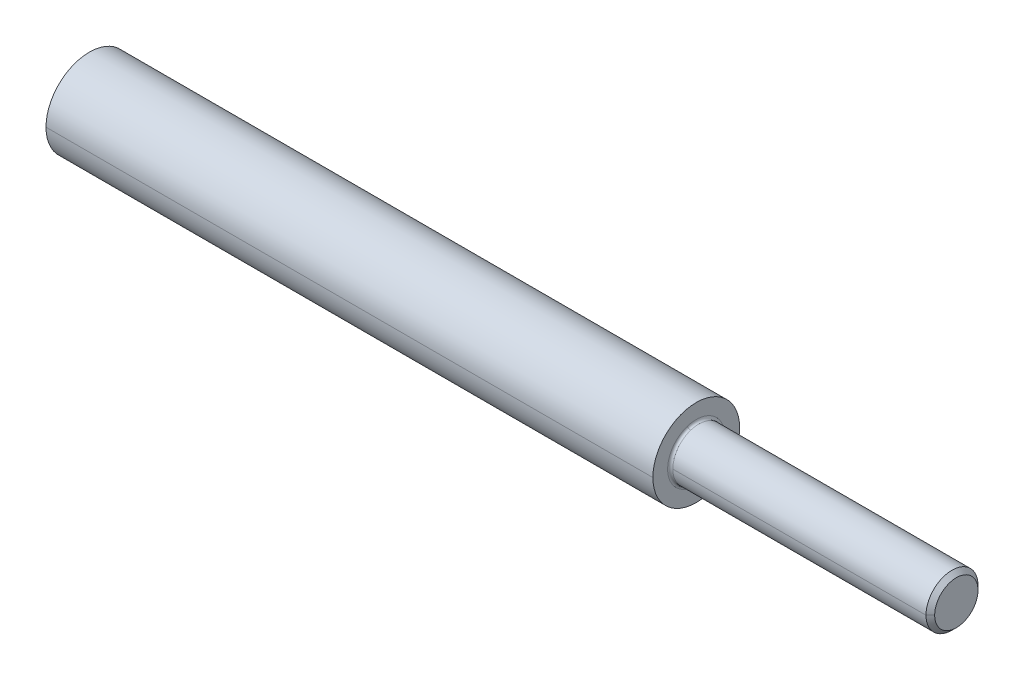
ISO-10303-21;
HEADER;
FILE_DESCRIPTION(('STEP AP214'),'2;1');
FILE_NAME('part.step','',(''),(''),'','','');
FILE_SCHEMA(('AUTOMOTIVE_DESIGN { 1 0 10303 214 1 1 1 1 }'));
ENDSEC;
DATA;
#1=APPLICATION_CONTEXT('core data for automotive mechanical design processes');
#2=APPLICATION_PROTOCOL_DEFINITION('international standard','automotive_design',2000,#1);
#3=PRODUCT_CONTEXT('',#1,'mechanical');
#4=PRODUCT('Part','Part','',(#3));
#5=PRODUCT_RELATED_PRODUCT_CATEGORY('part','',(#4));
#6=PRODUCT_DEFINITION_FORMATION('','',#4);
#7=PRODUCT_DEFINITION_CONTEXT('part definition',#1,'design');
#8=PRODUCT_DEFINITION('design','',#6,#7);
#9=PRODUCT_DEFINITION_SHAPE('','',#8);
#10=(LENGTH_UNIT() NAMED_UNIT(*) SI_UNIT(.MILLI.,.METRE.));
#11=(NAMED_UNIT(*) PLANE_ANGLE_UNIT() SI_UNIT($,.RADIAN.));
#12=(NAMED_UNIT(*) SI_UNIT($,.STERADIAN.) SOLID_ANGLE_UNIT());
#13=UNCERTAINTY_MEASURE_WITH_UNIT(LENGTH_MEASURE(1.E-05),#10,'distance_accuracy_value','');
#14=(GEOMETRIC_REPRESENTATION_CONTEXT(3) GLOBAL_UNCERTAINTY_ASSIGNED_CONTEXT((#13)) GLOBAL_UNIT_ASSIGNED_CONTEXT((#10,
#11,#12)) REPRESENTATION_CONTEXT('',''));
#15=CARTESIAN_POINT('',(0.,0.,0.));
#16=DIRECTION('',(0.,0.,1.));
#17=DIRECTION('',(1.,0.,0.));
#18=AXIS2_PLACEMENT_3D('',#15,#16,#17);
#19=CARTESIAN_POINT('',(0.,0.,0.));
#20=DIRECTION('',(1.,0.,0.));
#21=DIRECTION('',(0.,0.,-1.));
#22=AXIS2_PLACEMENT_3D('',#19,#20,#21);
#23=PLANE('',#22);
#24=CARTESIAN_POINT('',(0.,0.,0.));
#25=DIRECTION('',(1.,0.,0.));
#26=DIRECTION('',(0.,0.,-1.));
#27=AXIS2_PLACEMENT_3D('',#24,#25,#26);
#28=CIRCLE('',#27,5.);
#29=CARTESIAN_POINT('',(0.,0.,5.));
#30=VERTEX_POINT('',#29);
#31=CARTESIAN_POINT('',(0.,0.,-5.));
#32=VERTEX_POINT('',#31);
#33=EDGE_CURVE('E11',#30,#32,#28,.T.);
#34=ORIENTED_EDGE('',*,*,#33,.F.);
#35=CARTESIAN_POINT('',(0.,0.,0.));
#36=DIRECTION('',(1.,0.,0.));
#37=DIRECTION('',(0.,0.,-1.));
#38=AXIS2_PLACEMENT_3D('',#35,#36,#37);
#39=CIRCLE('',#38,5.);
#40=EDGE_CURVE('E24',#32,#30,#39,.T.);
#41=ORIENTED_EDGE('',*,*,#40,.F.);
#42=EDGE_LOOP('',(#34,#41));
#43=FACE_BOUND('',#42,.T.);
#44=ADVANCED_FACE('F16',(#43),#23,.F.);
#45=CARTESIAN_POINT('',(70.,0.,0.));
#46=DIRECTION('',(1.,0.,0.));
#47=DIRECTION('',(0.,-1.,0.));
#48=AXIS2_PLACEMENT_3D('',#45,#46,#47);
#49=CYLINDRICAL_SURFACE('',#48,5.);
#50=DIRECTION('',(1.,0.,0.));
#51=VECTOR('',#50,1.);
#52=CARTESIAN_POINT('',(0.,0.,5.));
#53=LINE('',#52,#51);
#54=CARTESIAN_POINT('',(70.,0.,5.));
#55=VERTEX_POINT('',#54);
#56=EDGE_CURVE('E219',#30,#55,#53,.T.);
#57=ORIENTED_EDGE('',*,*,#56,.T.);
#58=CARTESIAN_POINT('',(70.,0.,0.));
#59=DIRECTION('',(1.,0.,0.));
#60=DIRECTION('',(0.,0.,-1.));
#61=AXIS2_PLACEMENT_3D('',#58,#59,#60);
#62=CIRCLE('',#61,5.);
#63=CARTESIAN_POINT('',(70.,0.,-5.));
#64=VERTEX_POINT('',#63);
#65=EDGE_CURVE('E222',#64,#55,#62,.T.);
#66=ORIENTED_EDGE('',*,*,#65,.F.);
#67=DIRECTION('',(1.,0.,0.));
#68=VECTOR('',#67,1.);
#69=CARTESIAN_POINT('',(0.,0.,-5.));
#70=LINE('',#69,#68);
#71=EDGE_CURVE('E226',#32,#64,#70,.T.);
#72=ORIENTED_EDGE('',*,*,#71,.F.);
#73=ORIENTED_EDGE('',*,*,#40,.T.);
#74=EDGE_LOOP('',(#57,#66,#72,#73));
#75=FACE_BOUND('',#74,.T.);
#76=ADVANCED_FACE('F210',(#75),#49,.T.);
#77=CARTESIAN_POINT('',(70.,0.,0.));
#78=DIRECTION('',(1.,0.,0.));
#79=DIRECTION('',(0.,1.,0.));
#80=AXIS2_PLACEMENT_3D('',#77,#78,#79);
#81=CYLINDRICAL_SURFACE('',#80,5.);
#82=ORIENTED_EDGE('',*,*,#56,.F.);
#83=ORIENTED_EDGE('',*,*,#33,.T.);
#84=ORIENTED_EDGE('',*,*,#71,.T.);
#85=CARTESIAN_POINT('',(70.,0.,0.));
#86=DIRECTION('',(1.,0.,0.));
#87=DIRECTION('',(0.,0.,-1.));
#88=AXIS2_PLACEMENT_3D('',#85,#86,#87);
#89=CIRCLE('',#88,5.);
#90=EDGE_CURVE('E189',#55,#64,#89,.T.);
#91=ORIENTED_EDGE('',*,*,#90,.F.);
#92=EDGE_LOOP('',(#82,#83,#84,#91));
#93=FACE_BOUND('',#92,.T.);
#94=ADVANCED_FACE('F159',(#93),#81,.T.);
#95=CARTESIAN_POINT('',(70.,5.,0.));
#96=DIRECTION('',(-1.,0.,0.));
#97=DIRECTION('',(0.,0.,1.));
#98=AXIS2_PLACEMENT_3D('',#95,#96,#97);
#99=PLANE('',#98);
#100=CARTESIAN_POINT('',(70.0000000000001,3.13848650377388,1.01975608143728));
#101=CARTESIAN_POINT('',(70.0000000000001,3.12180185639339,1.07110985257327));
#102=CARTESIAN_POINT('',(70.0000000000001,3.10385469803049,1.12205330654705));
#103=CARTESIAN_POINT('',(70.0000000000001,3.06548330203598,1.2229986419036));
#104=CARTESIAN_POINT('',(70.0000000000001,3.04505906440437,1.27300052328636));
#105=CARTESIAN_POINT('',(70.0000000000001,3.00178145256848,1.37194177519426));
#106=CARTESIAN_POINT('',(70.0000000000001,2.97892807836422,1.4208811457194));
#107=CARTESIAN_POINT('',(70.0000000000001,2.93084758706894,1.51757960512457));
#108=CARTESIAN_POINT('',(70.0000000000001,2.90562046997793,1.56533869400461));
#109=CARTESIAN_POINT('',(70.0000000000001,2.8528531767023,1.65956149987516));
#110=CARTESIAN_POINT('',(70.0000000000001,2.82531300051768,1.70602521686567));
#111=CARTESIAN_POINT('',(70.0000000000001,2.76798596001204,1.79754535301495));
#112=CARTESIAN_POINT('',(70.0000000000001,2.73819909569102,1.84260177217373));
#113=CARTESIAN_POINT('',(70.0000000000001,2.67645043157715,1.93119876532836));
#114=CARTESIAN_POINT('',(70.0000000000001,2.64448863178431,1.97473933932421));
#115=CARTESIAN_POINT('',(70.0000000000001,2.57846709724384,2.06019974975861));
#116=CARTESIAN_POINT('',(70.0000000000001,2.54440736249622,2.10211958619717));
#117=CARTESIAN_POINT('',(70.0000000000001,2.47427201046378,2.18423753278186));
#118=CARTESIAN_POINT('',(70.0000000000001,2.43819639317895,2.224435642928));
#119=CARTESIAN_POINT('',(70.0000000000001,2.36411618551905,2.30301329620709));
#120=CARTESIAN_POINT('',(70.0000000000001,2.32611159514396,2.34139283934005));
#121=CARTESIAN_POINT('',(70.0000000000001,2.24826499765705,2.41624089889901));
#122=CARTESIAN_POINT('',(70.0000000000001,2.20842299054522,2.45270941532501));
#123=CARTESIAN_POINT('',(70.0000000000001,2.12699754247868,2.52364756562312));
#124=CARTESIAN_POINT('',(70.0000000000001,2.08541410152396,2.55811719949523));
#125=CARTESIAN_POINT('',(70.0000000000001,2.00060596392078,2.62497454431747));
#126=CARTESIAN_POINT('',(70.0000000000001,1.95738126727231,2.6573622552676));
#127=CARTESIAN_POINT('',(70.0000000000001,1.86939475036253,2.71997772941361));
#128=CARTESIAN_POINT('',(70.0000000000001,1.82463293010121,2.75020549260949));
#129=CARTESIAN_POINT('',(70.0000000000001,1.73368000111125,2.80842824991777));
#130=CARTESIAN_POINT('',(70.0000000000001,1.6874888923826,2.83642324403016));
#131=CARTESIAN_POINT('',(70.0000000000001,1.59378866488479,2.89011302077859));
#132=CARTESIAN_POINT('',(70.0000000000001,1.54627954611564,2.91580780341462));
#133=CARTESIAN_POINT('',(70.0000000000001,1.45005775216525,2.96483525622836));
#134=CARTESIAN_POINT('',(70.0000000000001,1.40134507698401,2.98816792640606));
#135=CARTESIAN_POINT('',(70.0000000000001,1.30283352331068,3.03241494385698));
#136=CARTESIAN_POINT('',(70.0000000000001,1.25303464481859,3.05332929113019));
#137=CARTESIAN_POINT('',(70.0000000000001,1.15247065438371,3.09268927827766));
#138=CARTESIAN_POINT('',(70.0000000000001,1.10170554244092,3.11113491815192));
#139=CARTESIAN_POINT('',(70.0000000000001,0.999331382705825,3.14551305333939));
#140=CARTESIAN_POINT('',(70.0000000000001,0.947722334913512,3.16144554865259));
#141=CARTESIAN_POINT('',(70.0000000000001,0.843784634195911,3.19075901194122));
#142=CARTESIAN_POINT('',(70.0000000000001,0.791455981270622,3.20413997991663));
#143=CARTESIAN_POINT('',(70.0000000000001,0.686205134595414,3.2283181526058));
#144=CARTESIAN_POINT('',(70.0000000000001,0.633282940845494,3.23911535731954));
#145=CARTESIAN_POINT('',(70.0000000000001,0.526972506721205,3.25809999207348));
#146=CARTESIAN_POINT('',(70.0000000000001,0.473584266346836,3.26628742211367));
#147=CARTESIAN_POINT('',(70.0000000000001,0.366470355920966,3.2800327832844));
#148=CARTESIAN_POINT('',(70.0000000000001,0.312744685869465,3.28559071441493));
#149=CARTESIAN_POINT('',(70.0000000000001,0.2050853459343,3.29406368822344));
#150=CARTESIAN_POINT('',(70.0000000000001,0.151151676050635,3.29697873090141));
#151=CARTESIAN_POINT('',(70.0000000000001,0.0432062673859232,3.30015890521166));
#152=CARTESIAN_POINT('',(70.0000000000001,-0.0108054713951234,3.30042403684392));
#153=CARTESIAN_POINT('',(70.0000000000001,-0.118776898845007,3.29830375033743));
#154=CARTESIAN_POINT('',(70.0000000000001,-0.172736587513844,3.29591833219867));
#155=CARTESIAN_POINT('',(70.0000000000001,-0.280473921122993,3.28850269283136));
#156=CARTESIAN_POINT('',(70.0000000000001,-0.334251566063306,3.28347247160281));
#157=CARTESIAN_POINT('',(70.0000000000001,-0.44149525715838,3.27077934429944));
#158=CARTESIAN_POINT('',(70.0000000000001,-0.494961303313142,3.26311643822463));
#159=CARTESIAN_POINT('',(70.0000000000001,-0.601452992448855,3.24517640184067));
#160=CARTESIAN_POINT('',(70.0000000000001,-0.654478635429806,3.23489927153152));
#161=CARTESIAN_POINT('',(70.0000000000001,-0.759961774799459,3.21175554518598));
#162=CARTESIAN_POINT('',(70.0000000000001,-0.812419271188161,3.19888894914958));
#163=CARTESIAN_POINT('',(70.0000000000001,-0.916639742669782,3.17059728810637));
#164=CARTESIAN_POINT('',(70.0000000000001,-0.968402717762701,3.15517222309956));
#165=CARTESIAN_POINT('',(70.0000000000001,-1.07110944511186,3.1218007844482));
#166=CARTESIAN_POINT('',(70.0000000000001,-1.12205319736809,3.10385441080365));
#167=CARTESIAN_POINT('',(70.0000000000001,-1.22299875108255,3.06548358926283));
#168=CARTESIAN_POINT('',(70.0000000000001,-1.27300055254077,3.04505914136657));
#169=CARTESIAN_POINT('',(70.0000000000001,-1.37194174593984,3.00178137560628));
#170=CARTESIAN_POINT('',(70.0000000000001,-1.42088113788069,2.97892805774226));
#171=CARTESIAN_POINT('',(70.0000000000001,-1.51757961296326,2.9308476076909));
#172=CARTESIAN_POINT('',(70.0000000000001,-1.56533869610498,2.90562047550357));
#173=CARTESIAN_POINT('',(70.0000000000001,-1.65956149777478,2.85285317117666));
#174=CARTESIAN_POINT('',(70.0000000000001,-1.70602521630287,2.82531299903709));
#175=CARTESIAN_POINT('',(70.0000000000001,-1.79754535357774,2.76798596149263));
#176=CARTESIAN_POINT('',(70.0000000000001,-1.84260177232452,2.73819909608774));
#177=CARTESIAN_POINT('',(70.0000000000001,-1.93119876517755,2.67645043118043));
#178=CARTESIAN_POINT('',(70.0000000000001,-1.97473933928379,2.64448863167801));
#179=CARTESIAN_POINT('',(70.0000000000001,-2.06019974979902,2.57846709735015));
#180=CARTESIAN_POINT('',(70.0000000000001,-2.10211958620799,2.54440736252471));
#181=CARTESIAN_POINT('',(70.0000000000001,-2.18423753277103,2.4742720104353));
#182=CARTESIAN_POINT('',(70.0000000000001,-2.22443564292509,2.43819639317133));
#183=CARTESIAN_POINT('',(70.0000000000001,-2.30301329620999,2.36411618552668));
#184=CARTESIAN_POINT('',(70.0000000000001,-2.34139283934083,2.32611159514601));
#185=CARTESIAN_POINT('',(70.0000000000001,-2.41624089889823,2.24826499765501));
#186=CARTESIAN_POINT('',(70.0000000000001,-2.4527094153248,2.20842299054468));
#187=CARTESIAN_POINT('',(70.0000000000001,-2.52364756562333,2.12699754247923));
#188=CARTESIAN_POINT('',(70.0000000000001,-2.55811719949528,2.08541410152411));
#189=CARTESIAN_POINT('',(70.0000000000001,-2.62497454431741,2.00060596392064));
#190=CARTESIAN_POINT('',(70.0000000000001,-2.65736225526758,1.95738126727228));
#191=CARTESIAN_POINT('',(70.0000000000001,-2.71997772941362,1.86939475036257));
#192=CARTESIAN_POINT('',(70.0000000000001,-2.75020549260949,1.82463293010123));
#193=CARTESIAN_POINT('',(70.0000000000001,-2.80842824991776,1.73368000111124));
#194=CARTESIAN_POINT('',(70.0000000000001,-2.83642324403016,1.6874888923826));
#195=CARTESIAN_POINT('',(70.0000000000001,-2.89011302077859,1.5937886648848));
#196=CARTESIAN_POINT('',(70.0000000000001,-2.91580780341462,1.54627954611565));
#197=CARTESIAN_POINT('',(70.0000000000001,-2.96483525622836,1.45005775216525));
#198=CARTESIAN_POINT('',(70.0000000000001,-2.98816792640606,1.40134507698401));
#199=CARTESIAN_POINT('',(70.0000000000001,-3.03241494385698,1.30283352331068));
#200=CARTESIAN_POINT('',(70.0000000000001,-3.0533292911302,1.25303464481859));
#201=CARTESIAN_POINT('',(70.0000000000001,-3.09268927827765,1.15247065438372));
#202=CARTESIAN_POINT('',(70.0000000000001,-3.11113491815188,1.10170554244094));
#203=CARTESIAN_POINT('',(70.0000000000001,-3.14551305333943,0.99933138270582));
#204=CARTESIAN_POINT('',(70.0000000000001,-3.16144554865274,0.947722334913477));
#205=CARTESIAN_POINT('',(70.0000000000001,-3.19075901194106,0.843784634195958));
#206=CARTESIAN_POINT('',(70.0000000000001,-3.20413997991607,0.791455981270783));
#207=CARTESIAN_POINT('',(70.0000000000001,-3.22831815260636,0.686205134595268));
#208=CARTESIAN_POINT('',(70.0000000000001,-3.23911535732165,0.633282940844928));
#209=CARTESIAN_POINT('',(70.0000000000001,-3.25809999207136,0.526972506721785));
#210=CARTESIAN_POINT('',(70.0000000000001,-3.26628742210579,0.473584266348982));
#211=CARTESIAN_POINT('',(70.0000000000001,-3.28003278329227,0.366470355918834));
#212=CARTESIAN_POINT('',(70.0000000000001,-3.28559071444434,0.312744685861489));
#213=CARTESIAN_POINT('',(70.0000000000001,-3.29406368819403,0.205085345942289));
#214=CARTESIAN_POINT('',(70.0000000000001,-3.29697873079166,0.151151676080434));
#215=CARTESIAN_POINT('',(70.0000000000001,-3.30015890532141,0.0432062673561374));
#216=CARTESIAN_POINT('',(70.0000000000001,-3.30042403725352,-0.010805471506305));
#217=CARTESIAN_POINT('',(70.0000000000001,-3.29830374992784,-0.118776898733812));
#218=CARTESIAN_POINT('',(70.0000000000001,-3.29591833067005,-0.172736587098877));
#219=CARTESIAN_POINT('',(70.0000000000001,-3.28850269435998,-0.280473921537946));
#220=CARTESIAN_POINT('',(70.0000000000001,-3.28347247730771,-0.33425156761195));
#221=CARTESIAN_POINT('',(70.0000000000001,-3.27077933859454,-0.441495255609721));
#222=CARTESIAN_POINT('',(70.0000000000001,-3.26311641693364,-0.494961297533488));
#223=CARTESIAN_POINT('',(70.0000000000001,-3.24517642313165,-0.601452998228492));
#224=CARTESIAN_POINT('',(70.0000000000001,-3.23489935099056,-0.654478656999728));
#225=CARTESIAN_POINT('',(70.0000000000001,-3.21175546572694,-0.759961753229521));
#226=CARTESIAN_POINT('',(70.0000000000001,-3.1988886526044,-0.812419190688079));
#227=CARTESIAN_POINT('',(70.0000000000001,-3.17059758465156,-0.91663982316985));
#228=CARTESIAN_POINT('',(70.0000000000001,-3.15517332982125,-0.968403018193064));
#229=CARTESIAN_POINT('',(70.0000000000001,-3.13848650377388,-1.01975608143727));
#230=B_SPLINE_CURVE_WITH_KNOTS('',3,(#100,#101,#102,#103,#104,#105,#106,#107,#108,#109,#110,
#111,#112,#113,#114,#115,#116,#117,#118,#119,#120,#121,#122,#123,#124,#125,#126,#127,#128,#129,
#130,#131,#132,#133,#134,#135,#136,#137,#138,#139,#140,#141,#142,#143,#144,#145,#146,#147,#148,
#149,#150,#151,#152,#153,#154,#155,#156,#157,#158,#159,#160,#161,#162,#163,#164,#165,#166,#167,
#168,#169,#170,#171,#172,#173,#174,#175,#176,#177,#178,#179,#180,#181,#182,#183,#184,#185,#186,
#187,#188,#189,#190,#191,#192,#193,#194,#195,#196,#197,#198,#199,#200,#201,#202,#203,#204,#205,
#206,#207,#208,#209,#210,#211,#212,#213,#214,#215,#216,#217,#218,#219,#220,#221,#222,#223,#224,
#225,#226,#227,#228,#229),.UNSPECIFIED.,.F.,.F.,(4,2,2,2,2,2,2,2,2,2,2,2,2,2,2,2,2,2,2,2,2,2,2,
2,2,2,2,2,2,2,2,2,2,2,2,2,2,2,2,2,2,2,2,2,2,2,2,2,2,2,2,2,2,2,2,2,2,2,2,2,2,2,2,2,4),(0.,
0.161972108251215,0.323944216502428,0.485916324753643,0.647888433004857,0.809860541256071,
0.971832649507286,1.1338047577585,1.29577686600971,1.45774897426093,1.61972108251214,
1.78169319076336,1.94366529901457,2.10563740726579,2.267609515517,2.42958162376821,
2.59155373201943,2.75352584027064,2.91549794852186,3.07747005677307,3.23944216502429,
3.4014142732755,3.56338638152672,3.72535848977793,3.88733059802914,4.04930270628036,
4.21127481453157,4.37324692278279,4.535219031034,4.69719113928522,4.85916324753643,
5.02113535578764,5.18310746403886,5.34507957229007,5.50705168054128,5.6690237887925,
5.83099589704371,5.99296800529493,6.15494011354614,6.31691222179736,6.47888433004857,
6.64085643829979,6.802828546551,6.96480065480222,7.12677276305343,7.28874487130464,
7.45071697955586,7.61268908780707,7.77466119605828,7.9366333043095,8.09860541256072,
8.26057752081193,8.42254962906314,8.58452173731435,8.74649384556557,8.90846595381678,
9.070438062068,9.23241017031921,9.39438227857043,9.55635438682164,9.71832649507285,
9.88029860332407,10.0422707115753,10.2042428198265,10.3662149280777),.UNSPECIFIED.);
#231=CARTESIAN_POINT('',(70.0000000000001,3.13848650377388,1.01975608143728));
#232=VERTEX_POINT('',#231);
#233=CARTESIAN_POINT('',(70.0000000000001,-3.13848650377388,-1.01975608143728));
#234=VERTEX_POINT('',#233);
#235=EDGE_CURVE('E181',#232,#234,#230,.T.);
#236=ORIENTED_EDGE('',*,*,#235,.F.);
#237=CARTESIAN_POINT('',(70.0000000000001,-3.13848650377388,-1.01975608143728));
#238=CARTESIAN_POINT('',(70.0000000000001,-3.12180185639339,-1.07110985257327));
#239=CARTESIAN_POINT('',(70.0000000000001,-3.10385469803049,-1.12205330654705));
#240=CARTESIAN_POINT('',(70.0000000000001,-3.06548330203598,-1.2229986419036));
#241=CARTESIAN_POINT('',(70.0000000000001,-3.04505906440437,-1.27300052328636));
#242=CARTESIAN_POINT('',(70.0000000000001,-3.00178145256848,-1.37194177519426));
#243=CARTESIAN_POINT('',(70.0000000000001,-2.97892807836422,-1.4208811457194));
#244=CARTESIAN_POINT('',(70.0000000000001,-2.93084758706894,-1.51757960512457));
#245=CARTESIAN_POINT('',(70.0000000000001,-2.90562046997793,-1.56533869400461));
#246=CARTESIAN_POINT('',(70.0000000000001,-2.8528531767023,-1.65956149987516));
#247=CARTESIAN_POINT('',(70.0000000000001,-2.82531300051768,-1.70602521686567));
#248=CARTESIAN_POINT('',(70.0000000000001,-2.76798596001204,-1.79754535301495));
#249=CARTESIAN_POINT('',(70.0000000000001,-2.73819909569102,-1.84260177217373));
#250=CARTESIAN_POINT('',(70.0000000000001,-2.67645043157715,-1.93119876532836));
#251=CARTESIAN_POINT('',(70.0000000000001,-2.64448863178431,-1.97473933932421));
#252=CARTESIAN_POINT('',(70.0000000000001,-2.57846709724384,-2.06019974975861));
#253=CARTESIAN_POINT('',(70.0000000000001,-2.54440736249622,-2.10211958619717));
#254=CARTESIAN_POINT('',(70.0000000000001,-2.47427201046378,-2.18423753278186));
#255=CARTESIAN_POINT('',(70.0000000000001,-2.43819639317895,-2.22443564292799));
#256=CARTESIAN_POINT('',(70.0000000000001,-2.36411618551905,-2.30301329620709));
#257=CARTESIAN_POINT('',(70.0000000000001,-2.32611159514396,-2.34139283934005));
#258=CARTESIAN_POINT('',(70.0000000000001,-2.24826499765705,-2.41624089889901));
#259=CARTESIAN_POINT('',(70.0000000000001,-2.20842299054522,-2.45270941532501));
#260=CARTESIAN_POINT('',(70.0000000000001,-2.12699754247868,-2.52364756562312));
#261=CARTESIAN_POINT('',(70.0000000000001,-2.08541410152396,-2.55811719949523));
#262=CARTESIAN_POINT('',(70.0000000000001,-2.00060596392078,-2.62497454431747));
#263=CARTESIAN_POINT('',(70.0000000000001,-1.95738126727231,-2.6573622552676));
#264=CARTESIAN_POINT('',(70.0000000000001,-1.86939475036253,-2.71997772941361));
#265=CARTESIAN_POINT('',(70.0000000000001,-1.82463293010121,-2.75020549260949));
#266=CARTESIAN_POINT('',(70.0000000000001,-1.73368000111125,-2.80842824991777));
#267=CARTESIAN_POINT('',(70.0000000000001,-1.6874888923826,-2.83642324403016));
#268=CARTESIAN_POINT('',(70.0000000000001,-1.5937886648848,-2.89011302077859));
#269=CARTESIAN_POINT('',(70.0000000000001,-1.54627954611564,-2.91580780341462));
#270=CARTESIAN_POINT('',(70.0000000000001,-1.45005775216525,-2.96483525622836));
#271=CARTESIAN_POINT('',(70.0000000000001,-1.40134507698401,-2.98816792640606));
#272=CARTESIAN_POINT('',(70.0000000000001,-1.30283352331068,-3.03241494385697));
#273=CARTESIAN_POINT('',(70.0000000000001,-1.25303464481859,-3.05332929113019));
#274=CARTESIAN_POINT('',(70.0000000000001,-1.15247065438371,-3.09268927827766));
#275=CARTESIAN_POINT('',(70.0000000000001,-1.10170554244093,-3.11113491815192));
#276=CARTESIAN_POINT('',(70.0000000000001,-0.999331382705827,-3.14551305333939));
#277=CARTESIAN_POINT('',(70.0000000000001,-0.947722334913515,-3.16144554865259));
#278=CARTESIAN_POINT('',(70.0000000000001,-0.843784634195914,-3.19075901194122));
#279=CARTESIAN_POINT('',(70.0000000000001,-0.791455981270625,-3.20413997991663));
#280=CARTESIAN_POINT('',(70.0000000000001,-0.686205134595417,-3.2283181526058));
#281=CARTESIAN_POINT('',(70.0000000000001,-0.633282940845498,-3.23911535731954));
#282=CARTESIAN_POINT('',(70.0000000000001,-0.526972506721209,-3.25809999207348));
#283=CARTESIAN_POINT('',(70.0000000000001,-0.473584266346839,-3.26628742211367));
#284=CARTESIAN_POINT('',(70.0000000000001,-0.366470355920969,-3.28003278328439));
#285=CARTESIAN_POINT('',(70.0000000000001,-0.312744685869468,-3.28559071441493));
#286=CARTESIAN_POINT('',(70.0000000000001,-0.205085345934303,-3.29406368822344));
#287=CARTESIAN_POINT('',(70.0000000000001,-0.151151676050638,-3.29697873090141));
#288=CARTESIAN_POINT('',(70.0000000000001,-0.0432062673859259,-3.30015890521166));
#289=CARTESIAN_POINT('',(70.0000000000001,0.0108054713951212,-3.30042403684392));
#290=CARTESIAN_POINT('',(70.0000000000001,0.118776898845005,-3.29830375033743));
#291=CARTESIAN_POINT('',(70.0000000000001,0.172736587513841,-3.29591833219867));
#292=CARTESIAN_POINT('',(70.0000000000001,0.28047392112299,-3.28850269283136));
#293=CARTESIAN_POINT('',(70.0000000000001,0.334251566063303,-3.28347247160281));
#294=CARTESIAN_POINT('',(70.0000000000001,0.441495257158376,-3.27077934429944));
#295=CARTESIAN_POINT('',(70.0000000000001,0.494961303313137,-3.26311643822463));
#296=CARTESIAN_POINT('',(70.0000000000001,0.60145299244885,-3.24517640184067));
#297=CARTESIAN_POINT('',(70.0000000000001,0.654478635429802,-3.23489927153152));
#298=CARTESIAN_POINT('',(70.0000000000001,0.759961774799457,-3.21175554518598));
#299=CARTESIAN_POINT('',(70.0000000000001,0.812419271188159,-3.19888894914958));
#300=CARTESIAN_POINT('',(70.0000000000001,0.91663974266978,-3.17059728810637));
#301=CARTESIAN_POINT('',(70.0000000000001,0.968402717762698,-3.15517222309956));
#302=CARTESIAN_POINT('',(70.0000000000001,1.07110944511185,-3.1218007844482));
#303=CARTESIAN_POINT('',(70.0000000000001,1.12205319736809,-3.10385441080365));
#304=CARTESIAN_POINT('',(70.0000000000001,1.22299875108254,-3.06548358926283));
#305=CARTESIAN_POINT('',(70.0000000000001,1.27300055254076,-3.04505914136657));
#306=CARTESIAN_POINT('',(70.0000000000001,1.37194174593984,-3.00178137560628));
#307=CARTESIAN_POINT('',(70.0000000000001,1.42088113788069,-2.97892805774226));
#308=CARTESIAN_POINT('',(70.0000000000001,1.51757961296326,-2.9308476076909));
#309=CARTESIAN_POINT('',(70.0000000000001,1.56533869610497,-2.90562047550357));
#310=CARTESIAN_POINT('',(70.0000000000001,1.65956149777478,-2.85285317117666));
#311=CARTESIAN_POINT('',(70.0000000000001,1.70602521630286,-2.82531299903709));
#312=CARTESIAN_POINT('',(70.0000000000001,1.79754535357774,-2.76798596149264));
#313=CARTESIAN_POINT('',(70.0000000000001,1.84260177232452,-2.73819909608775));
#314=CARTESIAN_POINT('',(70.0000000000001,1.93119876517755,-2.67645043118043));
#315=CARTESIAN_POINT('',(70.0000000000001,1.97473933928379,-2.64448863167801));
#316=CARTESIAN_POINT('',(70.0000000000001,2.06019974979901,-2.57846709735015));
#317=CARTESIAN_POINT('',(70.0000000000001,2.10211958620799,-2.54440736252471));
#318=CARTESIAN_POINT('',(70.0000000000001,2.18423753277103,-2.4742720104353));
#319=CARTESIAN_POINT('',(70.0000000000001,2.22443564292508,-2.43819639317133));
#320=CARTESIAN_POINT('',(70.0000000000001,2.30301329620998,-2.36411618552669));
#321=CARTESIAN_POINT('',(70.0000000000001,2.34139283934082,-2.32611159514601));
#322=CARTESIAN_POINT('',(70.0000000000001,2.41624089889823,-2.24826499765501));
#323=CARTESIAN_POINT('',(70.0000000000001,2.4527094153248,-2.20842299054468));
#324=CARTESIAN_POINT('',(70.0000000000001,2.52364756562332,-2.12699754247923));
#325=CARTESIAN_POINT('',(70.0000000000001,2.55811719949528,-2.08541410152412));
#326=CARTESIAN_POINT('',(70.0000000000001,2.62497454431741,-2.00060596392064));
#327=CARTESIAN_POINT('',(70.0000000000001,2.65736225526758,-1.95738126727228));
#328=CARTESIAN_POINT('',(70.0000000000001,2.71997772941362,-1.86939475036258));
#329=CARTESIAN_POINT('',(70.0000000000001,2.75020549260949,-1.82463293010123));
#330=CARTESIAN_POINT('',(70.0000000000001,2.80842824991776,-1.73368000111125));
#331=CARTESIAN_POINT('',(70.0000000000001,2.83642324403015,-1.6874888923826));
#332=CARTESIAN_POINT('',(70.0000000000001,2.89011302077859,-1.59378866488481));
#333=CARTESIAN_POINT('',(70.0000000000001,2.91580780341462,-1.54627954611565));
#334=CARTESIAN_POINT('',(70.0000000000001,2.96483525622835,-1.45005775216526));
#335=CARTESIAN_POINT('',(70.0000000000001,2.98816792640605,-1.40134507698402));
#336=CARTESIAN_POINT('',(70.0000000000001,3.03241494385697,-1.30283352331068));
#337=CARTESIAN_POINT('',(70.0000000000001,3.05332929113019,-1.25303464481859));
#338=CARTESIAN_POINT('',(70.0000000000001,3.09268927827765,-1.15247065438372));
#339=CARTESIAN_POINT('',(70.0000000000001,3.11113491815188,-1.10170554244094));
#340=CARTESIAN_POINT('',(70.0000000000001,3.14551305333942,-0.999331382705824));
#341=CARTESIAN_POINT('',(70.0000000000001,3.16144554865274,-0.947722334913482));
#342=CARTESIAN_POINT('',(70.0000000000001,3.19075901194106,-0.843784634195963));
#343=CARTESIAN_POINT('',(70.0000000000001,3.20413997991607,-0.791455981270787));
#344=CARTESIAN_POINT('',(70.0000000000001,3.22831815260636,-0.686205134595272));
#345=CARTESIAN_POINT('',(70.0000000000001,3.23911535732165,-0.633282940844933));
#346=CARTESIAN_POINT('',(70.0000000000001,3.25809999207136,-0.52697250672179));
#347=CARTESIAN_POINT('',(70.0000000000001,3.26628742210578,-0.473584266348987));
#348=CARTESIAN_POINT('',(70.0000000000001,3.28003278329227,-0.366470355918839));
#349=CARTESIAN_POINT('',(70.0000000000001,3.28559071444434,-0.312744685861494));
#350=CARTESIAN_POINT('',(70.0000000000001,3.29406368819403,-0.205085345942295));
#351=CARTESIAN_POINT('',(70.0000000000001,3.29697873079166,-0.151151676080441));
#352=CARTESIAN_POINT('',(70.0000000000001,3.3001589053214,-0.0432062673561437));
#353=CARTESIAN_POINT('',(70.0000000000001,3.30042403725352,0.0108054715062987));
#354=CARTESIAN_POINT('',(70.0000000000001,3.29830374992784,0.118776898733806));
#355=CARTESIAN_POINT('',(70.0000000000001,3.29591833067005,0.172736587098871));
#356=CARTESIAN_POINT('',(70.0000000000001,3.28850269435998,0.280473921537939));
#357=CARTESIAN_POINT('',(70.0000000000001,3.28347247730771,0.334251567611943));
#358=CARTESIAN_POINT('',(70.0000000000001,3.27077933859454,0.441495255609715));
#359=CARTESIAN_POINT('',(70.0000000000001,3.26311641693364,0.494961297533484));
#360=CARTESIAN_POINT('',(70.0000000000001,3.24517642313165,0.601452998228488));
#361=CARTESIAN_POINT('',(70.0000000000001,3.23489935099056,0.654478656999724));
#362=CARTESIAN_POINT('',(70.0000000000001,3.21175546572694,0.759961753229518));
#363=CARTESIAN_POINT('',(70.0000000000001,3.1988886526044,0.812419190688075));
#364=CARTESIAN_POINT('',(70.0000000000001,3.17059758465156,0.916639823169846));
#365=CARTESIAN_POINT('',(70.0000000000001,3.15517332982125,0.968403018193059));
#366=CARTESIAN_POINT('',(70.0000000000001,3.13848650377388,1.01975608143727));
#367=B_SPLINE_CURVE_WITH_KNOTS('',3,(#237,#238,#239,#240,#241,#242,#243,#244,#245,#246,#247,
#248,#249,#250,#251,#252,#253,#254,#255,#256,#257,#258,#259,#260,#261,#262,#263,#264,#265,#266,
#267,#268,#269,#270,#271,#272,#273,#274,#275,#276,#277,#278,#279,#280,#281,#282,#283,#284,#285,
#286,#287,#288,#289,#290,#291,#292,#293,#294,#295,#296,#297,#298,#299,#300,#301,#302,#303,#304,
#305,#306,#307,#308,#309,#310,#311,#312,#313,#314,#315,#316,#317,#318,#319,#320,#321,#322,#323,
#324,#325,#326,#327,#328,#329,#330,#331,#332,#333,#334,#335,#336,#337,#338,#339,#340,#341,#342,
#343,#344,#345,#346,#347,#348,#349,#350,#351,#352,#353,#354,#355,#356,#357,#358,#359,#360,#361,
#362,#363,#364,#365,#366),.UNSPECIFIED.,.F.,.F.,(4,2,2,2,2,2,2,2,2,2,2,2,2,2,2,2,2,2,2,2,2,2,2,
2,2,2,2,2,2,2,2,2,2,2,2,2,2,2,2,2,2,2,2,2,2,2,2,2,2,2,2,2,2,2,2,2,2,2,2,2,2,2,2,2,4),(0.,
0.161972108251215,0.323944216502428,0.485916324753642,0.647888433004856,0.809860541256071,
0.971832649507285,1.1338047577585,1.29577686600971,1.45774897426093,1.61972108251214,
1.78169319076336,1.94366529901457,2.10563740726578,2.267609515517,2.42958162376821,
2.59155373201943,2.75352584027064,2.91549794852186,3.07747005677307,3.23944216502428,
3.4014142732755,3.56338638152671,3.72535848977793,3.88733059802914,4.04930270628036,
4.21127481453157,4.37324692278278,4.535219031034,4.69719113928521,4.85916324753643,
5.02113535578764,5.18310746403886,5.34507957229007,5.50705168054128,5.6690237887925,
5.83099589704371,5.99296800529493,6.15494011354614,6.31691222179736,6.47888433004857,
6.64085643829978,6.802828546551,6.96480065480221,7.12677276305343,7.28874487130464,
7.45071697955585,7.61268908780707,7.77466119605828,7.9366333043095,8.09860541256071,
8.26057752081192,8.42254962906314,8.58452173731435,8.74649384556557,8.90846595381678,
9.07043806206799,9.23241017031921,9.39438227857042,9.55635438682163,9.71832649507284,
9.88029860332406,10.0422707115753,10.2042428198265,10.3662149280777),.UNSPECIFIED.);
#368=EDGE_CURVE('E177',#234,#232,#367,.T.);
#369=ORIENTED_EDGE('',*,*,#368,.F.);
#370=EDGE_LOOP('',(#236,#369));
#371=FACE_BOUND('',#370,.T.);
#372=ORIENTED_EDGE('',*,*,#65,.T.);
#373=ORIENTED_EDGE('',*,*,#90,.T.);
#374=EDGE_LOOP('',(#372,#373));
#375=FACE_BOUND('',#374,.T.);
#376=ADVANCED_FACE('F153',(#371,#375),#99,.F.);
#377=CARTESIAN_POINT('',(70.3,0.,0.));
#378=DIRECTION('',(1.,0.,0.));
#379=DIRECTION('',(0.,-0.309016994374947,0.951056516295154));
#380=AXIS2_PLACEMENT_3D('',#377,#378,#379);
#381=TOROIDAL_SURFACE('',#380,3.29999999999987,0.29999999999987);
#382=CARTESIAN_POINT('',(70.3,-3.13848650377388,-1.01975608143728));
#383=DIRECTION('',(0.,0.309016994374947,-0.951056516295154));
#384=DIRECTION('',(-1.,0.,0.));
#385=AXIS2_PLACEMENT_3D('',#382,#383,#384);
#386=CIRCLE('',#385,0.299999999999869);
#387=CARTESIAN_POINT('',(70.3,-2.85316954888546,-0.92705098312484));
#388=VERTEX_POINT('',#387);
#389=EDGE_CURVE('E133',#234,#388,#386,.T.);
#390=ORIENTED_EDGE('',*,*,#389,.F.);
#391=ORIENTED_EDGE('',*,*,#368,.T.);
#392=CARTESIAN_POINT('',(70.3,3.13848650377388,1.01975608143728));
#393=DIRECTION('',(0.,-0.309016994374947,0.951056516295154));
#394=DIRECTION('',(-1.,0.,0.));
#395=AXIS2_PLACEMENT_3D('',#392,#393,#394);
#396=CIRCLE('',#395,0.299999999999869);
#397=CARTESIAN_POINT('',(70.3,2.85316954888546,0.92705098312484));
#398=VERTEX_POINT('',#397);
#399=EDGE_CURVE('E129',#232,#398,#396,.T.);
#400=ORIENTED_EDGE('',*,*,#399,.T.);
#401=CARTESIAN_POINT('',(70.3,0.,0.));
#402=DIRECTION('',(1.,0.,0.));
#403=DIRECTION('',(0.,0.,-1.));
#404=AXIS2_PLACEMENT_3D('',#401,#402,#403);
#405=CIRCLE('',#404,3.);
#406=CARTESIAN_POINT('',(70.3,0.,-3.));
#407=VERTEX_POINT('',#406);
#408=EDGE_CURVE('E124',#407,#398,#405,.T.);
#409=ORIENTED_EDGE('',*,*,#408,.F.);
#410=CARTESIAN_POINT('',(70.3,0.,0.));
#411=DIRECTION('',(1.,0.,0.));
#412=DIRECTION('',(0.,0.,-1.));
#413=AXIS2_PLACEMENT_3D('',#410,#411,#412);
#414=CIRCLE('',#413,3.);
#415=EDGE_CURVE('E119',#388,#407,#414,.T.);
#416=ORIENTED_EDGE('',*,*,#415,.F.);
#417=EDGE_LOOP('',(#390,#391,#400,#409,#416));
#418=FACE_BOUND('',#417,.T.);
#419=ADVANCED_FACE('F142',(#418),#381,.F.);
#420=CARTESIAN_POINT('',(100.,0.,0.));
#421=DIRECTION('',(1.,0.,0.));
#422=DIRECTION('',(0.,1.,-1.61702901641324E-09));
#423=AXIS2_PLACEMENT_3D('',#420,#421,#422);
#424=CYLINDRICAL_SURFACE('',#423,3.);
#425=DIRECTION('',(1.,0.,0.));
#426=VECTOR('',#425,1.);
#427=CARTESIAN_POINT('',(70.3,0.,3.));
#428=LINE('',#427,#426);
#429=CARTESIAN_POINT('',(70.3,0.,3.));
#430=VERTEX_POINT('',#429);
#431=CARTESIAN_POINT('',(99.5,0.,3.));
#432=VERTEX_POINT('',#431);
#433=EDGE_CURVE('E114',#430,#432,#428,.T.);
#434=ORIENTED_EDGE('',*,*,#433,.F.);
#435=CARTESIAN_POINT('',(70.3,0.,0.));
#436=DIRECTION('',(1.,0.,0.));
#437=DIRECTION('',(0.,0.,-1.));
#438=AXIS2_PLACEMENT_3D('',#435,#436,#437);
#439=CIRCLE('',#438,3.);
#440=EDGE_CURVE('E109',#430,#388,#439,.T.);
#441=ORIENTED_EDGE('',*,*,#440,.T.);
#442=ORIENTED_EDGE('',*,*,#415,.T.);
#443=DIRECTION('',(1.,0.,0.));
#444=VECTOR('',#443,1.);
#445=CARTESIAN_POINT('',(70.3,0.,-3.));
#446=LINE('',#445,#444);
#447=CARTESIAN_POINT('',(99.5,0.,-3.));
#448=VERTEX_POINT('',#447);
#449=EDGE_CURVE('E105',#407,#448,#446,.T.);
#450=ORIENTED_EDGE('',*,*,#449,.T.);
#451=CARTESIAN_POINT('',(99.5,0.,0.));
#452=DIRECTION('',(1.,0.,0.));
#453=DIRECTION('',(0.,0.,-1.));
#454=AXIS2_PLACEMENT_3D('',#451,#452,#453);
#455=CIRCLE('',#454,3.);
#456=EDGE_CURVE('E101',#432,#448,#455,.T.);
#457=ORIENTED_EDGE('',*,*,#456,.F.);
#458=EDGE_LOOP('',(#434,#441,#442,#450,#457));
#459=FACE_BOUND('',#458,.T.);
#460=ADVANCED_FACE('F152',(#459),#424,.T.);
#461=CARTESIAN_POINT('',(99.5,0.,0.));
#462=DIRECTION('',(-1.,0.,0.));
#463=DIRECTION('',(0.,1.,0.));
#464=AXIS2_PLACEMENT_3D('',#461,#462,#463);
#465=CONICAL_SURFACE('',#464,3.,0.785398163397448);
#466=DIRECTION('',(-0.707106781186548,0.,-0.707106781186548));
#467=VECTOR('',#466,1.);
#468=CARTESIAN_POINT('',(100.,0.,-2.5));
#469=LINE('',#468,#467);
#470=CARTESIAN_POINT('',(100.,0.,-2.5));
#471=VERTEX_POINT('',#470);
#472=EDGE_CURVE('E78',#471,#448,#469,.T.);
#473=ORIENTED_EDGE('',*,*,#472,.F.);
#474=CARTESIAN_POINT('',(100.,0.,0.));
#475=DIRECTION('',(1.,0.,0.));
#476=DIRECTION('',(0.,0.,-1.));
#477=AXIS2_PLACEMENT_3D('',#474,#475,#476);
#478=CIRCLE('',#477,2.5);
#479=CARTESIAN_POINT('',(100.,0.,2.5));
#480=VERTEX_POINT('',#479);
#481=EDGE_CURVE('E71',#480,#471,#478,.T.);
#482=ORIENTED_EDGE('',*,*,#481,.F.);
#483=DIRECTION('',(-0.707106781186548,0.,0.707106781186548));
#484=VECTOR('',#483,1.);
#485=CARTESIAN_POINT('',(100.,0.,2.5));
#486=LINE('',#485,#484);
#487=EDGE_CURVE('E76',#480,#432,#486,.T.);
#488=ORIENTED_EDGE('',*,*,#487,.T.);
#489=ORIENTED_EDGE('',*,*,#456,.T.);
#490=EDGE_LOOP('',(#473,#482,#488,#489));
#491=FACE_BOUND('',#490,.T.);
#492=ADVANCED_FACE('F73',(#491),#465,.T.);
#493=CARTESIAN_POINT('',(99.5,0.,0.));
#494=DIRECTION('',(-1.,0.,0.));
#495=DIRECTION('',(0.,-1.,0.));
#496=AXIS2_PLACEMENT_3D('',#493,#494,#495);
#497=CONICAL_SURFACE('',#496,3.,0.785398163397448);
#498=ORIENTED_EDGE('',*,*,#472,.T.);
#499=CARTESIAN_POINT('',(99.5,0.,0.));
#500=DIRECTION('',(1.,0.,0.));
#501=DIRECTION('',(0.,0.,-1.));
#502=AXIS2_PLACEMENT_3D('',#499,#500,#501);
#503=CIRCLE('',#502,3.);
#504=EDGE_CURVE('E85',#448,#432,#503,.T.);
#505=ORIENTED_EDGE('',*,*,#504,.T.);
#506=ORIENTED_EDGE('',*,*,#487,.F.);
#507=CARTESIAN_POINT('',(100.,0.,0.));
#508=DIRECTION('',(1.,0.,0.));
#509=DIRECTION('',(0.,0.,-1.));
#510=AXIS2_PLACEMENT_3D('',#507,#508,#509);
#511=CIRCLE('',#510,2.5);
#512=EDGE_CURVE('E82',#471,#480,#511,.T.);
#513=ORIENTED_EDGE('',*,*,#512,.F.);
#514=EDGE_LOOP('',(#498,#505,#506,#513));
#515=FACE_BOUND('',#514,.T.);
#516=ADVANCED_FACE('F89',(#515),#497,.T.);
#517=CARTESIAN_POINT('',(100.,2.5,0.));
#518=DIRECTION('',(-1.,0.,0.));
#519=DIRECTION('',(0.,0.,1.));
#520=AXIS2_PLACEMENT_3D('',#517,#518,#519);
#521=PLANE('',#520);
#522=ORIENTED_EDGE('',*,*,#512,.T.);
#523=ORIENTED_EDGE('',*,*,#481,.T.);
#524=EDGE_LOOP('',(#522,#523));
#525=FACE_BOUND('',#524,.T.);
#526=ADVANCED_FACE('F83',(#525),#521,.F.);
#527=CARTESIAN_POINT('',(100.,0.,0.));
#528=DIRECTION('',(1.,0.,0.));
#529=DIRECTION('',(0.,-1.,0.));
#530=AXIS2_PLACEMENT_3D('',#527,#528,#529);
#531=CYLINDRICAL_SURFACE('',#530,3.);
#532=ORIENTED_EDGE('',*,*,#433,.T.);
#533=ORIENTED_EDGE('',*,*,#504,.F.);
#534=ORIENTED_EDGE('',*,*,#449,.F.);
#535=ORIENTED_EDGE('',*,*,#408,.T.);
#536=CARTESIAN_POINT('',(70.3,0.,0.));
#537=DIRECTION('',(1.,0.,0.));
#538=DIRECTION('',(0.,0.,-1.));
#539=AXIS2_PLACEMENT_3D('',#536,#537,#538);
#540=CIRCLE('',#539,3.);
#541=EDGE_CURVE('E86',#398,#430,#540,.T.);
#542=ORIENTED_EDGE('',*,*,#541,.T.);
#543=EDGE_LOOP('',(#532,#533,#534,#535,#542));
#544=FACE_BOUND('',#543,.T.);
#545=ADVANCED_FACE('F201',(#544),#531,.T.);
#546=CARTESIAN_POINT('',(70.3,0.,0.));
#547=DIRECTION('',(1.,0.,0.));
#548=DIRECTION('',(0.,0.309016994374947,-0.951056516295154));
#549=AXIS2_PLACEMENT_3D('',#546,#547,#548);
#550=TOROIDAL_SURFACE('',#549,3.29999999999987,0.29999999999987);
#551=ORIENTED_EDGE('',*,*,#389,.T.);
#552=ORIENTED_EDGE('',*,*,#440,.F.);
#553=ORIENTED_EDGE('',*,*,#541,.F.);
#554=ORIENTED_EDGE('',*,*,#399,.F.);
#555=ORIENTED_EDGE('',*,*,#235,.T.);
#556=EDGE_LOOP('',(#551,#552,#553,#554,#555));
#557=FACE_BOUND('',#556,.T.);
#558=ADVANCED_FACE('F187',(#557),#550,.F.);
#559=CLOSED_SHELL('',(#44,#76,#94,#376,#419,#460,#492,#516,#526,#545,#558));
#560=MANIFOLD_SOLID_BREP('B1',#559);
#561=ADVANCED_BREP_SHAPE_REPRESENTATION('',(#18,#560),#14);
#562=SHAPE_DEFINITION_REPRESENTATION(#9,#561);
ENDSEC;
END-ISO-10303-21;
